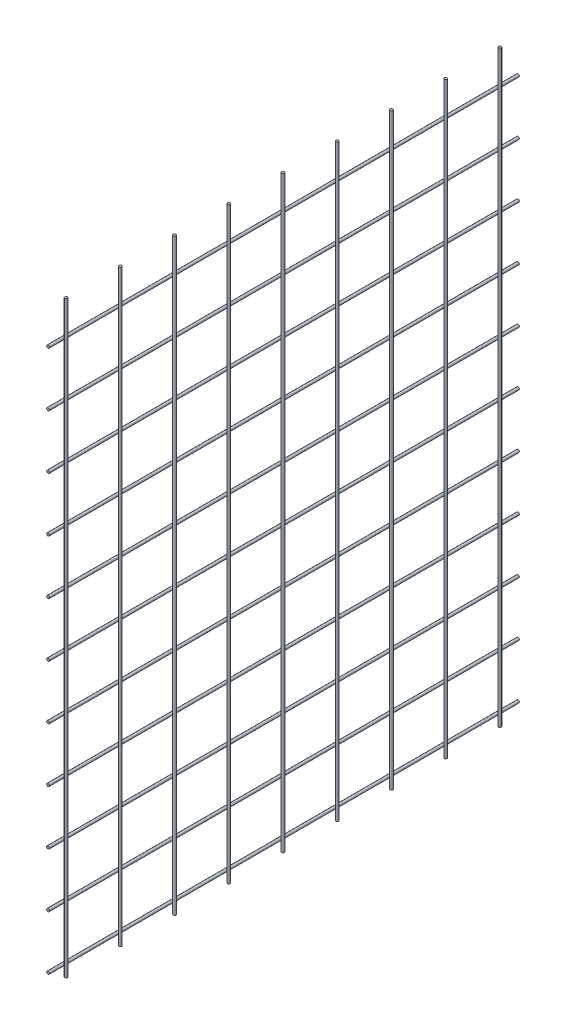
ISO-10303-21;
HEADER;
FILE_DESCRIPTION(('STEP AP214'),'2;1');
FILE_NAME('part.step','',(''),(''),'','','');
FILE_SCHEMA(('AUTOMOTIVE_DESIGN { 1 0 10303 214 1 1 1 1 }'));
ENDSEC;
DATA;
#1=APPLICATION_CONTEXT('core data for automotive mechanical design processes');
#2=APPLICATION_PROTOCOL_DEFINITION('international standard','automotive_design',2000,#1);
#3=PRODUCT_CONTEXT('',#1,'mechanical');
#4=PRODUCT('Part','Part','',(#3));
#5=PRODUCT_RELATED_PRODUCT_CATEGORY('part','',(#4));
#6=PRODUCT_DEFINITION_FORMATION('','',#4);
#7=PRODUCT_DEFINITION_CONTEXT('part definition',#1,'design');
#8=PRODUCT_DEFINITION('design','',#6,#7);
#9=PRODUCT_DEFINITION_SHAPE('','',#8);
#10=(LENGTH_UNIT() NAMED_UNIT(*) SI_UNIT(.MILLI.,.METRE.));
#11=(NAMED_UNIT(*) PLANE_ANGLE_UNIT() SI_UNIT($,.RADIAN.));
#12=(NAMED_UNIT(*) SI_UNIT($,.STERADIAN.) SOLID_ANGLE_UNIT());
#13=UNCERTAINTY_MEASURE_WITH_UNIT(LENGTH_MEASURE(1.E-05),#10,'distance_accuracy_value','');
#14=(GEOMETRIC_REPRESENTATION_CONTEXT(3) GLOBAL_UNCERTAINTY_ASSIGNED_CONTEXT((#13)) GLOBAL_UNIT_ASSIGNED_CONTEXT((#10,
#11,#12)) REPRESENTATION_CONTEXT('',''));
#15=CARTESIAN_POINT('',(0.,0.,0.));
#16=DIRECTION('',(0.,0.,1.));
#17=DIRECTION('',(1.,0.,0.));
#18=AXIS2_PLACEMENT_3D('',#15,#16,#17);
#19=CARTESIAN_POINT('',(-20.0100000000001,1940.,-1843.));
#20=DIRECTION('',(0.,0.,1.));
#21=DIRECTION('',(1.,0.,0.));
#22=AXIS2_PLACEMENT_3D('',#19,#20,#21);
#23=PLANE('',#22);
#24=CARTESIAN_POINT('',(3.10862446895044E-12,1300.,-1843.));
#25=DIRECTION('',(0.,0.,1.));
#26=DIRECTION('',(1.,0.,0.));
#27=AXIS2_PLACEMENT_3D('',#24,#25,#26);
#28=CIRCLE('',#27,1.49999999999986);
#29=CARTESIAN_POINT('',(1.50000000000297,1300.,-1843.));
#30=VERTEX_POINT('',#29);
#31=EDGE_CURVE('E11',#30,#30,#28,.T.);
#32=ORIENTED_EDGE('',*,*,#31,.T.);
#33=EDGE_LOOP('',(#32));
#34=FACE_BOUND('',#33,.T.);
#35=ADVANCED_FACE('F52',(#34),#23,.T.);
#36=CARTESIAN_POINT('',(-20.0100000000001,1940.,-2363.));
#37=DIRECTION('',(0.,0.,-1.));
#38=DIRECTION('',(-1.,0.,0.));
#39=AXIS2_PLACEMENT_3D('',#36,#37,#38);
#40=PLANE('',#39);
#41=CARTESIAN_POINT('',(-2.22044604925031E-12,1300.,-2363.));
#42=DIRECTION('',(0.,0.,-1.));
#43=DIRECTION('',(-1.,0.,0.));
#44=AXIS2_PLACEMENT_3D('',#41,#42,#43);
#45=CIRCLE('',#44,1.49999999999986);
#46=CARTESIAN_POINT('',(-1.50000000000209,1300.,-2363.));
#47=VERTEX_POINT('',#46);
#48=EDGE_CURVE('E60',#47,#47,#45,.T.);
#49=ORIENTED_EDGE('',*,*,#48,.T.);
#50=EDGE_LOOP('',(#49));
#51=FACE_BOUND('',#50,.T.);
#52=ADVANCED_FACE('F69',(#51),#40,.T.);
#53=CARTESIAN_POINT('',(3.10862446895044E-12,1300.,-3080.002));
#54=DIRECTION('',(0.,0.,1.));
#55=DIRECTION('',(1.,0.,0.));
#56=AXIS2_PLACEMENT_3D('',#53,#54,#55);
#57=CYLINDRICAL_SURFACE('',#56,1.49999999999986);
#58=ORIENTED_EDGE('',*,*,#48,.F.);
#59=EDGE_LOOP('',(#58));
#60=FACE_BOUND('',#59,.T.);
#61=ORIENTED_EDGE('',*,*,#31,.F.);
#62=EDGE_LOOP('',(#61));
#63=FACE_BOUND('',#62,.T.);
#64=ADVANCED_FACE('F54',(#60,#63),#57,.T.);
#65=CLOSED_SHELL('',(#35,#52,#64));
#66=MANIFOLD_SOLID_BREP('B2',#65);
#67=CARTESIAN_POINT('',(-20.0100000000001,1940.,-1843.));
#68=DIRECTION('',(0.,0.,1.));
#69=DIRECTION('',(1.,0.,0.));
#70=AXIS2_PLACEMENT_3D('',#67,#68,#69);
#71=PLANE('',#70);
#72=CARTESIAN_POINT('',(-2.22044604925031E-12,1360.,-1843.));
#73=DIRECTION('',(0.,0.,1.));
#74=DIRECTION('',(1.,0.,0.));
#75=AXIS2_PLACEMENT_3D('',#72,#73,#74);
#76=CIRCLE('',#75,1.49999999999986);
#77=CARTESIAN_POINT('',(1.49999999999764,1360.,-1843.));
#78=VERTEX_POINT('',#77);
#79=EDGE_CURVE('E51',#78,#78,#76,.T.);
#80=ORIENTED_EDGE('',*,*,#79,.T.);
#81=EDGE_LOOP('',(#80));
#82=FACE_BOUND('',#81,.T.);
#83=ADVANCED_FACE('F99',(#82),#71,.T.);
#84=CARTESIAN_POINT('',(-20.0100000000001,1940.,-2363.));
#85=DIRECTION('',(0.,0.,-1.));
#86=DIRECTION('',(-1.,0.,0.));
#87=AXIS2_PLACEMENT_3D('',#84,#85,#86);
#88=PLANE('',#87);
#89=CARTESIAN_POINT('',(-2.22044604925031E-12,1360.,-2363.));
#90=DIRECTION('',(0.,0.,-1.));
#91=DIRECTION('',(-1.,0.,0.));
#92=AXIS2_PLACEMENT_3D('',#89,#90,#91);
#93=CIRCLE('',#92,1.49999999999986);
#94=CARTESIAN_POINT('',(-1.50000000000209,1360.,-2363.));
#95=VERTEX_POINT('',#94);
#96=EDGE_CURVE('E107',#95,#95,#93,.T.);
#97=ORIENTED_EDGE('',*,*,#96,.T.);
#98=EDGE_LOOP('',(#97));
#99=FACE_BOUND('',#98,.T.);
#100=ADVANCED_FACE('F116',(#99),#88,.T.);
#101=CARTESIAN_POINT('',(3.10862446895044E-12,1360.,-3080.002));
#102=DIRECTION('',(0.,0.,1.));
#103=DIRECTION('',(1.,0.,0.));
#104=AXIS2_PLACEMENT_3D('',#101,#102,#103);
#105=CYLINDRICAL_SURFACE('',#104,1.49999999999986);
#106=ORIENTED_EDGE('',*,*,#96,.F.);
#107=EDGE_LOOP('',(#106));
#108=FACE_BOUND('',#107,.T.);
#109=ORIENTED_EDGE('',*,*,#79,.F.);
#110=EDGE_LOOP('',(#109));
#111=FACE_BOUND('',#110,.T.);
#112=ADVANCED_FACE('F101',(#108,#111),#105,.T.);
#113=CLOSED_SHELL('',(#83,#100,#112));
#114=MANIFOLD_SOLID_BREP('B6',#113);
#115=CARTESIAN_POINT('',(-20.0100000000001,1940.,-1843.));
#116=DIRECTION('',(0.,0.,1.));
#117=DIRECTION('',(1.,0.,0.));
#118=AXIS2_PLACEMENT_3D('',#115,#116,#117);
#119=PLANE('',#118);
#120=CARTESIAN_POINT('',(-2.22044604925031E-12,1420.,-1843.));
#121=DIRECTION('',(0.,0.,1.));
#122=DIRECTION('',(1.,0.,0.));
#123=AXIS2_PLACEMENT_3D('',#120,#121,#122);
#124=CIRCLE('',#123,1.49999999999986);
#125=CARTESIAN_POINT('',(1.49999999999764,1420.,-1843.));
#126=VERTEX_POINT('',#125);
#127=EDGE_CURVE('E98',#126,#126,#124,.T.);
#128=ORIENTED_EDGE('',*,*,#127,.T.);
#129=EDGE_LOOP('',(#128));
#130=FACE_BOUND('',#129,.T.);
#131=ADVANCED_FACE('F146',(#130),#119,.T.);
#132=CARTESIAN_POINT('',(-20.0100000000001,1940.,-2363.));
#133=DIRECTION('',(0.,0.,-1.));
#134=DIRECTION('',(-1.,0.,0.));
#135=AXIS2_PLACEMENT_3D('',#132,#133,#134);
#136=PLANE('',#135);
#137=CARTESIAN_POINT('',(-2.22044604925031E-12,1420.,-2363.));
#138=DIRECTION('',(0.,0.,-1.));
#139=DIRECTION('',(-1.,0.,0.));
#140=AXIS2_PLACEMENT_3D('',#137,#138,#139);
#141=CIRCLE('',#140,1.49999999999986);
#142=CARTESIAN_POINT('',(-1.50000000000209,1420.,-2363.));
#143=VERTEX_POINT('',#142);
#144=EDGE_CURVE('E154',#143,#143,#141,.T.);
#145=ORIENTED_EDGE('',*,*,#144,.T.);
#146=EDGE_LOOP('',(#145));
#147=FACE_BOUND('',#146,.T.);
#148=ADVANCED_FACE('F163',(#147),#136,.T.);
#149=CARTESIAN_POINT('',(3.10862446895044E-12,1420.,-3080.002));
#150=DIRECTION('',(0.,0.,1.));
#151=DIRECTION('',(1.,0.,0.));
#152=AXIS2_PLACEMENT_3D('',#149,#150,#151);
#153=CYLINDRICAL_SURFACE('',#152,1.49999999999986);
#154=ORIENTED_EDGE('',*,*,#144,.F.);
#155=EDGE_LOOP('',(#154));
#156=FACE_BOUND('',#155,.T.);
#157=ORIENTED_EDGE('',*,*,#127,.F.);
#158=EDGE_LOOP('',(#157));
#159=FACE_BOUND('',#158,.T.);
#160=ADVANCED_FACE('F148',(#156,#159),#153,.T.);
#161=CLOSED_SHELL('',(#131,#148,#160));
#162=MANIFOLD_SOLID_BREP('B46',#161);
#163=CARTESIAN_POINT('',(-20.0100000000001,1940.,-1843.));
#164=DIRECTION('',(0.,0.,1.));
#165=DIRECTION('',(1.,0.,0.));
#166=AXIS2_PLACEMENT_3D('',#163,#164,#165);
#167=PLANE('',#166);
#168=CARTESIAN_POINT('',(-8.88178419700125E-13,1480.,-1843.));
#169=DIRECTION('',(0.,0.,1.));
#170=DIRECTION('',(1.,0.,0.));
#171=AXIS2_PLACEMENT_3D('',#168,#169,#170);
#172=CIRCLE('',#171,1.49999999999986);
#173=CARTESIAN_POINT('',(1.49999999999898,1480.,-1843.));
#174=VERTEX_POINT('',#173);
#175=EDGE_CURVE('E145',#174,#174,#172,.T.);
#176=ORIENTED_EDGE('',*,*,#175,.T.);
#177=EDGE_LOOP('',(#176));
#178=FACE_BOUND('',#177,.T.);
#179=ADVANCED_FACE('F193',(#178),#167,.T.);
#180=CARTESIAN_POINT('',(-20.0100000000001,1940.,-2363.));
#181=DIRECTION('',(0.,0.,-1.));
#182=DIRECTION('',(-1.,0.,0.));
#183=AXIS2_PLACEMENT_3D('',#180,#181,#182);
#184=PLANE('',#183);
#185=CARTESIAN_POINT('',(-8.88178419700125E-13,1480.,-2363.));
#186=DIRECTION('',(0.,0.,-1.));
#187=DIRECTION('',(-1.,0.,0.));
#188=AXIS2_PLACEMENT_3D('',#185,#186,#187);
#189=CIRCLE('',#188,1.49999999999986);
#190=CARTESIAN_POINT('',(-1.50000000000075,1480.,-2363.));
#191=VERTEX_POINT('',#190);
#192=EDGE_CURVE('E201',#191,#191,#189,.T.);
#193=ORIENTED_EDGE('',*,*,#192,.T.);
#194=EDGE_LOOP('',(#193));
#195=FACE_BOUND('',#194,.T.);
#196=ADVANCED_FACE('F210',(#195),#184,.T.);
#197=CARTESIAN_POINT('',(-8.88178419700125E-13,1480.,-3080.002));
#198=DIRECTION('',(0.,0.,1.));
#199=DIRECTION('',(1.,0.,0.));
#200=AXIS2_PLACEMENT_3D('',#197,#198,#199);
#201=CYLINDRICAL_SURFACE('',#200,1.49999999999986);
#202=ORIENTED_EDGE('',*,*,#192,.F.);
#203=EDGE_LOOP('',(#202));
#204=FACE_BOUND('',#203,.T.);
#205=ORIENTED_EDGE('',*,*,#175,.F.);
#206=EDGE_LOOP('',(#205));
#207=FACE_BOUND('',#206,.T.);
#208=ADVANCED_FACE('F195',(#204,#207),#201,.T.);
#209=CLOSED_SHELL('',(#179,#196,#208));
#210=MANIFOLD_SOLID_BREP('B93',#209);
#211=CARTESIAN_POINT('',(-20.0100000000001,1940.,-1843.));
#212=DIRECTION('',(0.,0.,1.));
#213=DIRECTION('',(1.,0.,0.));
#214=AXIS2_PLACEMENT_3D('',#211,#212,#213);
#215=PLANE('',#214);
#216=CARTESIAN_POINT('',(-8.88178419700125E-13,1540.,-1843.));
#217=DIRECTION('',(0.,0.,1.));
#218=DIRECTION('',(1.,0.,0.));
#219=AXIS2_PLACEMENT_3D('',#216,#217,#218);
#220=CIRCLE('',#219,1.49999999999986);
#221=CARTESIAN_POINT('',(1.49999999999898,1540.,-1843.));
#222=VERTEX_POINT('',#221);
#223=EDGE_CURVE('E192',#222,#222,#220,.T.);
#224=ORIENTED_EDGE('',*,*,#223,.T.);
#225=EDGE_LOOP('',(#224));
#226=FACE_BOUND('',#225,.T.);
#227=ADVANCED_FACE('F240',(#226),#215,.T.);
#228=CARTESIAN_POINT('',(-20.0100000000001,1940.,-2363.));
#229=DIRECTION('',(0.,0.,-1.));
#230=DIRECTION('',(-1.,0.,0.));
#231=AXIS2_PLACEMENT_3D('',#228,#229,#230);
#232=PLANE('',#231);
#233=CARTESIAN_POINT('',(-8.88178419700125E-13,1540.,-2363.));
#234=DIRECTION('',(0.,0.,-1.));
#235=DIRECTION('',(-1.,0.,0.));
#236=AXIS2_PLACEMENT_3D('',#233,#234,#235);
#237=CIRCLE('',#236,1.49999999999986);
#238=CARTESIAN_POINT('',(-1.50000000000075,1540.,-2363.));
#239=VERTEX_POINT('',#238);
#240=EDGE_CURVE('E248',#239,#239,#237,.T.);
#241=ORIENTED_EDGE('',*,*,#240,.T.);
#242=EDGE_LOOP('',(#241));
#243=FACE_BOUND('',#242,.T.);
#244=ADVANCED_FACE('F257',(#243),#232,.T.);
#245=CARTESIAN_POINT('',(4.44089209850063E-12,1540.,-3080.002));
#246=DIRECTION('',(0.,0.,1.));
#247=DIRECTION('',(1.,0.,0.));
#248=AXIS2_PLACEMENT_3D('',#245,#246,#247);
#249=CYLINDRICAL_SURFACE('',#248,1.49999999999986);
#250=ORIENTED_EDGE('',*,*,#240,.F.);
#251=EDGE_LOOP('',(#250));
#252=FACE_BOUND('',#251,.T.);
#253=ORIENTED_EDGE('',*,*,#223,.F.);
#254=EDGE_LOOP('',(#253));
#255=FACE_BOUND('',#254,.T.);
#256=ADVANCED_FACE('F242',(#252,#255),#249,.T.);
#257=CLOSED_SHELL('',(#227,#244,#256));
#258=MANIFOLD_SOLID_BREP('B140',#257);
#259=CARTESIAN_POINT('',(-20.0100000000001,1940.,-1843.));
#260=DIRECTION('',(0.,0.,1.));
#261=DIRECTION('',(1.,0.,0.));
#262=AXIS2_PLACEMENT_3D('',#259,#260,#261);
#263=PLANE('',#262);
#264=CARTESIAN_POINT('',(4.44089209850063E-12,1600.,-1843.));
#265=DIRECTION('',(0.,0.,1.));
#266=DIRECTION('',(1.,0.,0.));
#267=AXIS2_PLACEMENT_3D('',#264,#265,#266);
#268=CIRCLE('',#267,1.49999999999986);
#269=CARTESIAN_POINT('',(1.50000000000431,1600.,-1843.));
#270=VERTEX_POINT('',#269);
#271=EDGE_CURVE('E239',#270,#270,#268,.T.);
#272=ORIENTED_EDGE('',*,*,#271,.T.);
#273=EDGE_LOOP('',(#272));
#274=FACE_BOUND('',#273,.T.);
#275=ADVANCED_FACE('F287',(#274),#263,.T.);
#276=CARTESIAN_POINT('',(-20.0100000000001,1940.,-2363.));
#277=DIRECTION('',(0.,0.,-1.));
#278=DIRECTION('',(-1.,0.,0.));
#279=AXIS2_PLACEMENT_3D('',#276,#277,#278);
#280=PLANE('',#279);
#281=CARTESIAN_POINT('',(4.44089209850063E-12,1600.,-2363.));
#282=DIRECTION('',(0.,0.,-1.));
#283=DIRECTION('',(-1.,0.,0.));
#284=AXIS2_PLACEMENT_3D('',#281,#282,#283);
#285=CIRCLE('',#284,1.49999999999986);
#286=CARTESIAN_POINT('',(-1.49999999999542,1600.,-2363.));
#287=VERTEX_POINT('',#286);
#288=EDGE_CURVE('E295',#287,#287,#285,.T.);
#289=ORIENTED_EDGE('',*,*,#288,.T.);
#290=EDGE_LOOP('',(#289));
#291=FACE_BOUND('',#290,.T.);
#292=ADVANCED_FACE('F304',(#291),#280,.T.);
#293=CARTESIAN_POINT('',(4.44089209850063E-12,1600.,-3080.002));
#294=DIRECTION('',(0.,0.,1.));
#295=DIRECTION('',(1.,0.,0.));
#296=AXIS2_PLACEMENT_3D('',#293,#294,#295);
#297=CYLINDRICAL_SURFACE('',#296,1.49999999999986);
#298=ORIENTED_EDGE('',*,*,#288,.F.);
#299=EDGE_LOOP('',(#298));
#300=FACE_BOUND('',#299,.T.);
#301=ORIENTED_EDGE('',*,*,#271,.F.);
#302=EDGE_LOOP('',(#301));
#303=FACE_BOUND('',#302,.T.);
#304=ADVANCED_FACE('F289',(#300,#303),#297,.T.);
#305=CLOSED_SHELL('',(#275,#292,#304));
#306=MANIFOLD_SOLID_BREP('B187',#305);
#307=CARTESIAN_POINT('',(-20.0100000000001,1940.,-1843.));
#308=DIRECTION('',(0.,0.,1.));
#309=DIRECTION('',(1.,0.,0.));
#310=AXIS2_PLACEMENT_3D('',#307,#308,#309);
#311=PLANE('',#310);
#312=CARTESIAN_POINT('',(0.,1660.,-1843.));
#313=DIRECTION('',(0.,0.,1.));
#314=DIRECTION('',(1.,0.,0.));
#315=AXIS2_PLACEMENT_3D('',#312,#313,#314);
#316=CIRCLE('',#315,1.49999999999986);
#317=CARTESIAN_POINT('',(1.49999999999986,1660.,-1843.));
#318=VERTEX_POINT('',#317);
#319=EDGE_CURVE('E286',#318,#318,#316,.T.);
#320=ORIENTED_EDGE('',*,*,#319,.T.);
#321=EDGE_LOOP('',(#320));
#322=FACE_BOUND('',#321,.T.);
#323=ADVANCED_FACE('F334',(#322),#311,.T.);
#324=CARTESIAN_POINT('',(-20.0100000000001,1940.,-2363.));
#325=DIRECTION('',(0.,0.,-1.));
#326=DIRECTION('',(-1.,0.,0.));
#327=AXIS2_PLACEMENT_3D('',#324,#325,#326);
#328=PLANE('',#327);
#329=CARTESIAN_POINT('',(0.,1660.,-2363.));
#330=DIRECTION('',(0.,0.,-1.));
#331=DIRECTION('',(-1.,0.,0.));
#332=AXIS2_PLACEMENT_3D('',#329,#330,#331);
#333=CIRCLE('',#332,1.49999999999986);
#334=CARTESIAN_POINT('',(-1.49999999999986,1660.,-2363.));
#335=VERTEX_POINT('',#334);
#336=EDGE_CURVE('E342',#335,#335,#333,.T.);
#337=ORIENTED_EDGE('',*,*,#336,.T.);
#338=EDGE_LOOP('',(#337));
#339=FACE_BOUND('',#338,.T.);
#340=ADVANCED_FACE('F351',(#339),#328,.T.);
#341=CARTESIAN_POINT('',(5.32907051820075E-12,1660.,-3080.002));
#342=DIRECTION('',(0.,0.,1.));
#343=DIRECTION('',(1.,0.,0.));
#344=AXIS2_PLACEMENT_3D('',#341,#342,#343);
#345=CYLINDRICAL_SURFACE('',#344,1.49999999999986);
#346=ORIENTED_EDGE('',*,*,#336,.F.);
#347=EDGE_LOOP('',(#346));
#348=FACE_BOUND('',#347,.T.);
#349=ORIENTED_EDGE('',*,*,#319,.F.);
#350=EDGE_LOOP('',(#349));
#351=FACE_BOUND('',#350,.T.);
#352=ADVANCED_FACE('F336',(#348,#351),#345,.T.);
#353=CLOSED_SHELL('',(#323,#340,#352));
#354=MANIFOLD_SOLID_BREP('B234',#353);
#355=CARTESIAN_POINT('',(-20.0100000000001,1940.,-1843.));
#356=DIRECTION('',(0.,0.,1.));
#357=DIRECTION('',(1.,0.,0.));
#358=AXIS2_PLACEMENT_3D('',#355,#356,#357);
#359=PLANE('',#358);
#360=CARTESIAN_POINT('',(5.32907051820075E-12,1720.,-1843.));
#361=DIRECTION('',(0.,0.,1.));
#362=DIRECTION('',(1.,0.,0.));
#363=AXIS2_PLACEMENT_3D('',#360,#361,#362);
#364=CIRCLE('',#363,1.49999999999986);
#365=CARTESIAN_POINT('',(1.50000000000519,1720.,-1843.));
#366=VERTEX_POINT('',#365);
#367=EDGE_CURVE('E333',#366,#366,#364,.T.);
#368=ORIENTED_EDGE('',*,*,#367,.T.);
#369=EDGE_LOOP('',(#368));
#370=FACE_BOUND('',#369,.T.);
#371=ADVANCED_FACE('F381',(#370),#359,.T.);
#372=CARTESIAN_POINT('',(-20.0100000000001,1940.,-2363.));
#373=DIRECTION('',(0.,0.,-1.));
#374=DIRECTION('',(-1.,0.,0.));
#375=AXIS2_PLACEMENT_3D('',#372,#373,#374);
#376=PLANE('',#375);
#377=CARTESIAN_POINT('',(0.,1720.,-2363.));
#378=DIRECTION('',(0.,0.,-1.));
#379=DIRECTION('',(-1.,0.,0.));
#380=AXIS2_PLACEMENT_3D('',#377,#378,#379);
#381=CIRCLE('',#380,1.49999999999986);
#382=CARTESIAN_POINT('',(-1.49999999999986,1720.,-2363.));
#383=VERTEX_POINT('',#382);
#384=EDGE_CURVE('E389',#383,#383,#381,.T.);
#385=ORIENTED_EDGE('',*,*,#384,.T.);
#386=EDGE_LOOP('',(#385));
#387=FACE_BOUND('',#386,.T.);
#388=ADVANCED_FACE('F398',(#387),#376,.T.);
#389=CARTESIAN_POINT('',(5.32907051820075E-12,1720.,-3080.002));
#390=DIRECTION('',(0.,0.,1.));
#391=DIRECTION('',(1.,0.,0.));
#392=AXIS2_PLACEMENT_3D('',#389,#390,#391);
#393=CYLINDRICAL_SURFACE('',#392,1.49999999999986);
#394=ORIENTED_EDGE('',*,*,#384,.F.);
#395=EDGE_LOOP('',(#394));
#396=FACE_BOUND('',#395,.T.);
#397=ORIENTED_EDGE('',*,*,#367,.F.);
#398=EDGE_LOOP('',(#397));
#399=FACE_BOUND('',#398,.T.);
#400=ADVANCED_FACE('F383',(#396,#399),#393,.T.);
#401=CLOSED_SHELL('',(#371,#388,#400));
#402=MANIFOLD_SOLID_BREP('B281',#401);
#403=CARTESIAN_POINT('',(-20.0100000000001,1940.,-1843.));
#404=DIRECTION('',(0.,0.,1.));
#405=DIRECTION('',(1.,0.,0.));
#406=AXIS2_PLACEMENT_3D('',#403,#404,#405);
#407=PLANE('',#406);
#408=CARTESIAN_POINT('',(0.,1780.,-1843.));
#409=DIRECTION('',(0.,0.,1.));
#410=DIRECTION('',(1.,0.,0.));
#411=AXIS2_PLACEMENT_3D('',#408,#409,#410);
#412=CIRCLE('',#411,1.49999999999986);
#413=CARTESIAN_POINT('',(1.49999999999986,1780.,-1843.));
#414=VERTEX_POINT('',#413);
#415=EDGE_CURVE('E380',#414,#414,#412,.T.);
#416=ORIENTED_EDGE('',*,*,#415,.T.);
#417=EDGE_LOOP('',(#416));
#418=FACE_BOUND('',#417,.T.);
#419=ADVANCED_FACE('F428',(#418),#407,.T.);
#420=CARTESIAN_POINT('',(-20.0100000000001,1940.,-2363.));
#421=DIRECTION('',(0.,0.,-1.));
#422=DIRECTION('',(-1.,0.,0.));
#423=AXIS2_PLACEMENT_3D('',#420,#421,#422);
#424=PLANE('',#423);
#425=CARTESIAN_POINT('',(0.,1780.,-2363.));
#426=DIRECTION('',(0.,0.,-1.));
#427=DIRECTION('',(-1.,0.,0.));
#428=AXIS2_PLACEMENT_3D('',#425,#426,#427);
#429=CIRCLE('',#428,1.49999999999986);
#430=CARTESIAN_POINT('',(-1.49999999999986,1780.,-2363.));
#431=VERTEX_POINT('',#430);
#432=EDGE_CURVE('E436',#431,#431,#429,.T.);
#433=ORIENTED_EDGE('',*,*,#432,.T.);
#434=EDGE_LOOP('',(#433));
#435=FACE_BOUND('',#434,.T.);
#436=ADVANCED_FACE('F445',(#435),#424,.T.);
#437=CARTESIAN_POINT('',(0.,1780.,-3080.002));
#438=DIRECTION('',(0.,0.,1.));
#439=DIRECTION('',(1.,0.,0.));
#440=AXIS2_PLACEMENT_3D('',#437,#438,#439);
#441=CYLINDRICAL_SURFACE('',#440,1.49999999999986);
#442=ORIENTED_EDGE('',*,*,#432,.F.);
#443=EDGE_LOOP('',(#442));
#444=FACE_BOUND('',#443,.T.);
#445=ORIENTED_EDGE('',*,*,#415,.F.);
#446=EDGE_LOOP('',(#445));
#447=FACE_BOUND('',#446,.T.);
#448=ADVANCED_FACE('F430',(#444,#447),#441,.T.);
#449=CLOSED_SHELL('',(#419,#436,#448));
#450=MANIFOLD_SOLID_BREP('B328',#449);
#451=CARTESIAN_POINT('',(-20.0100000000001,1940.,-1843.));
#452=DIRECTION('',(0.,0.,1.));
#453=DIRECTION('',(1.,0.,0.));
#454=AXIS2_PLACEMENT_3D('',#451,#452,#453);
#455=PLANE('',#454);
#456=CARTESIAN_POINT('',(0.,1840.,-1843.));
#457=DIRECTION('',(0.,0.,1.));
#458=DIRECTION('',(1.,0.,0.));
#459=AXIS2_PLACEMENT_3D('',#456,#457,#458);
#460=CIRCLE('',#459,1.49999999999986);
#461=CARTESIAN_POINT('',(1.49999999999986,1840.,-1843.));
#462=VERTEX_POINT('',#461);
#463=EDGE_CURVE('E427',#462,#462,#460,.T.);
#464=ORIENTED_EDGE('',*,*,#463,.T.);
#465=EDGE_LOOP('',(#464));
#466=FACE_BOUND('',#465,.T.);
#467=ADVANCED_FACE('F475',(#466),#455,.T.);
#468=CARTESIAN_POINT('',(-20.0100000000001,1940.,-2363.));
#469=DIRECTION('',(0.,0.,-1.));
#470=DIRECTION('',(-1.,0.,0.));
#471=AXIS2_PLACEMENT_3D('',#468,#469,#470);
#472=PLANE('',#471);
#473=CARTESIAN_POINT('',(0.,1840.,-2363.));
#474=DIRECTION('',(0.,0.,-1.));
#475=DIRECTION('',(-1.,0.,0.));
#476=AXIS2_PLACEMENT_3D('',#473,#474,#475);
#477=CIRCLE('',#476,1.49999999999986);
#478=CARTESIAN_POINT('',(-1.49999999999986,1840.,-2363.));
#479=VERTEX_POINT('',#478);
#480=EDGE_CURVE('E483',#479,#479,#477,.T.);
#481=ORIENTED_EDGE('',*,*,#480,.T.);
#482=EDGE_LOOP('',(#481));
#483=FACE_BOUND('',#482,.T.);
#484=ADVANCED_FACE('F492',(#483),#472,.T.);
#485=CARTESIAN_POINT('',(5.32907051820075E-12,1840.,-3080.002));
#486=DIRECTION('',(0.,0.,1.));
#487=DIRECTION('',(1.,0.,0.));
#488=AXIS2_PLACEMENT_3D('',#485,#486,#487);
#489=CYLINDRICAL_SURFACE('',#488,1.49999999999986);
#490=ORIENTED_EDGE('',*,*,#480,.F.);
#491=EDGE_LOOP('',(#490));
#492=FACE_BOUND('',#491,.T.);
#493=ORIENTED_EDGE('',*,*,#463,.F.);
#494=EDGE_LOOP('',(#493));
#495=FACE_BOUND('',#494,.T.);
#496=ADVANCED_FACE('F477',(#492,#495),#489,.T.);
#497=CLOSED_SHELL('',(#467,#484,#496));
#498=MANIFOLD_SOLID_BREP('B375',#497);
#499=CARTESIAN_POINT('',(-20.0100000000001,1940.,-1843.));
#500=DIRECTION('',(0.,0.,1.));
#501=DIRECTION('',(1.,0.,0.));
#502=AXIS2_PLACEMENT_3D('',#499,#500,#501);
#503=PLANE('',#502);
#504=CARTESIAN_POINT('',(0.,1900.,-1843.));
#505=DIRECTION('',(0.,0.,1.));
#506=DIRECTION('',(1.,0.,0.));
#507=AXIS2_PLACEMENT_3D('',#504,#505,#506);
#508=CIRCLE('',#507,1.49999999999986);
#509=CARTESIAN_POINT('',(1.49999999999986,1900.,-1843.));
#510=VERTEX_POINT('',#509);
#511=EDGE_CURVE('E474',#510,#510,#508,.T.);
#512=ORIENTED_EDGE('',*,*,#511,.T.);
#513=EDGE_LOOP('',(#512));
#514=FACE_BOUND('',#513,.T.);
#515=ADVANCED_FACE('F522',(#514),#503,.T.);
#516=CARTESIAN_POINT('',(-20.0100000000001,1940.,-2363.));
#517=DIRECTION('',(0.,0.,-1.));
#518=DIRECTION('',(-1.,0.,0.));
#519=AXIS2_PLACEMENT_3D('',#516,#517,#518);
#520=PLANE('',#519);
#521=CARTESIAN_POINT('',(0.,1900.,-2363.));
#522=DIRECTION('',(0.,0.,-1.));
#523=DIRECTION('',(-1.,0.,0.));
#524=AXIS2_PLACEMENT_3D('',#521,#522,#523);
#525=CIRCLE('',#524,1.49999999999986);
#526=CARTESIAN_POINT('',(-1.49999999999986,1900.,-2363.));
#527=VERTEX_POINT('',#526);
#528=EDGE_CURVE('E530',#527,#527,#525,.T.);
#529=ORIENTED_EDGE('',*,*,#528,.T.);
#530=EDGE_LOOP('',(#529));
#531=FACE_BOUND('',#530,.T.);
#532=ADVANCED_FACE('F539',(#531),#520,.T.);
#533=CARTESIAN_POINT('',(0.,1900.,-3080.002));
#534=DIRECTION('',(0.,0.,1.));
#535=DIRECTION('',(1.,0.,0.));
#536=AXIS2_PLACEMENT_3D('',#533,#534,#535);
#537=CYLINDRICAL_SURFACE('',#536,1.49999999999986);
#538=ORIENTED_EDGE('',*,*,#528,.F.);
#539=EDGE_LOOP('',(#538));
#540=FACE_BOUND('',#539,.T.);
#541=ORIENTED_EDGE('',*,*,#511,.F.);
#542=EDGE_LOOP('',(#541));
#543=FACE_BOUND('',#542,.T.);
#544=ADVANCED_FACE('F524',(#540,#543),#537,.T.);
#545=CLOSED_SHELL('',(#515,#532,#544));
#546=MANIFOLD_SOLID_BREP('B422',#545);
#547=CARTESIAN_POINT('',(-20.0100000000005,1289.,-1843.));
#548=DIRECTION('',(0.,-1.,0.));
#549=DIRECTION('',(0.,0.,-1.));
#550=AXIS2_PLACEMENT_3D('',#547,#548,#549);
#551=PLANE('',#550);
#552=CARTESIAN_POINT('',(3.00000000000411,1289.,-2340.));
#553=DIRECTION('',(0.,-1.,0.));
#554=DIRECTION('',(0.,0.,-1.));
#555=AXIS2_PLACEMENT_3D('',#552,#553,#554);
#556=CIRCLE('',#555,1.5);
#557=CARTESIAN_POINT('',(3.00000000000411,1289.,-2341.5));
#558=VERTEX_POINT('',#557);
#559=EDGE_CURVE('E573',#558,#558,#556,.T.);
#560=ORIENTED_EDGE('',*,*,#559,.T.);
#561=EDGE_LOOP('',(#560));
#562=FACE_BOUND('',#561,.T.);
#563=ADVANCED_FACE('F569',(#562),#551,.T.);
#564=CARTESIAN_POINT('',(3.00000000000544,1980.002,-2340.));
#565=DIRECTION('',(0.,-1.,0.));
#566=DIRECTION('',(0.,0.,-1.));
#567=AXIS2_PLACEMENT_3D('',#564,#565,#566);
#568=CYLINDRICAL_SURFACE('',#567,1.5);
#569=CARTESIAN_POINT('',(3.00000000000011,1940.,-2340.));
#570=DIRECTION('',(0.,1.,0.));
#571=DIRECTION('',(0.,0.,1.));
#572=AXIS2_PLACEMENT_3D('',#569,#570,#571);
#573=CIRCLE('',#572,1.5);
#574=CARTESIAN_POINT('',(3.00000000000011,1940.,-2338.5));
#575=VERTEX_POINT('',#574);
#576=EDGE_CURVE('E521',#575,#575,#573,.T.);
#577=ORIENTED_EDGE('',*,*,#576,.F.);
#578=EDGE_LOOP('',(#577));
#579=FACE_BOUND('',#578,.T.);
#580=ORIENTED_EDGE('',*,*,#559,.F.);
#581=EDGE_LOOP('',(#580));
#582=FACE_BOUND('',#581,.T.);
#583=ADVANCED_FACE('F571',(#579,#582),#568,.T.);
#584=CARTESIAN_POINT('',(-15.5000000000003,1940.,-3060.));
#585=DIRECTION('',(0.,1.,0.));
#586=DIRECTION('',(0.,0.,1.));
#587=AXIS2_PLACEMENT_3D('',#584,#585,#586);
#588=PLANE('',#587);
#589=ORIENTED_EDGE('',*,*,#576,.T.);
#590=EDGE_LOOP('',(#589));
#591=FACE_BOUND('',#590,.T.);
#592=ADVANCED_FACE('F588',(#591),#588,.T.);
#593=CLOSED_SHELL('',(#563,#583,#592));
#594=MANIFOLD_SOLID_BREP('B469',#593);
#595=CARTESIAN_POINT('',(-20.0100000000005,1289.,-1843.));
#596=DIRECTION('',(0.,-1.,0.));
#597=DIRECTION('',(0.,0.,-1.));
#598=AXIS2_PLACEMENT_3D('',#595,#596,#597);
#599=PLANE('',#598);
#600=CARTESIAN_POINT('',(2.99999999999923,1289.,-2280.));
#601=DIRECTION('',(0.,-1.,0.));
#602=DIRECTION('',(0.,0.,-1.));
#603=AXIS2_PLACEMENT_3D('',#600,#601,#602);
#604=CIRCLE('',#603,1.5);
#605=CARTESIAN_POINT('',(2.99999999999923,1289.,-2281.5));
#606=VERTEX_POINT('',#605);
#607=EDGE_CURVE('E620',#606,#606,#604,.T.);
#608=ORIENTED_EDGE('',*,*,#607,.T.);
#609=EDGE_LOOP('',(#608));
#610=FACE_BOUND('',#609,.T.);
#611=ADVANCED_FACE('F616',(#610),#599,.T.);
#612=CARTESIAN_POINT('',(3.00000000000544,1980.002,-2280.));
#613=DIRECTION('',(0.,-1.,0.));
#614=DIRECTION('',(0.,0.,-1.));
#615=AXIS2_PLACEMENT_3D('',#612,#613,#614);
#616=CYLINDRICAL_SURFACE('',#615,1.5);
#617=CARTESIAN_POINT('',(3.00000000000011,1940.,-2280.));
#618=DIRECTION('',(0.,1.,0.));
#619=DIRECTION('',(0.,0.,1.));
#620=AXIS2_PLACEMENT_3D('',#617,#618,#619);
#621=CIRCLE('',#620,1.5);
#622=CARTESIAN_POINT('',(3.00000000000011,1940.,-2278.5));
#623=VERTEX_POINT('',#622);
#624=EDGE_CURVE('E568',#623,#623,#621,.T.);
#625=ORIENTED_EDGE('',*,*,#624,.F.);
#626=EDGE_LOOP('',(#625));
#627=FACE_BOUND('',#626,.T.);
#628=ORIENTED_EDGE('',*,*,#607,.F.);
#629=EDGE_LOOP('',(#628));
#630=FACE_BOUND('',#629,.T.);
#631=ADVANCED_FACE('F618',(#627,#630),#616,.T.);
#632=CARTESIAN_POINT('',(-15.5000000000003,1940.,-3060.));
#633=DIRECTION('',(0.,1.,0.));
#634=DIRECTION('',(0.,0.,1.));
#635=AXIS2_PLACEMENT_3D('',#632,#633,#634);
#636=PLANE('',#635);
#637=ORIENTED_EDGE('',*,*,#624,.T.);
#638=EDGE_LOOP('',(#637));
#639=FACE_BOUND('',#638,.T.);
#640=ADVANCED_FACE('F635',(#639),#636,.T.);
#641=CLOSED_SHELL('',(#611,#631,#640));
#642=MANIFOLD_SOLID_BREP('B516',#641);
#643=CARTESIAN_POINT('',(-20.0100000000005,1289.,-1843.));
#644=DIRECTION('',(0.,-1.,0.));
#645=DIRECTION('',(0.,0.,-1.));
#646=AXIS2_PLACEMENT_3D('',#643,#644,#645);
#647=PLANE('',#646);
#648=CARTESIAN_POINT('',(2.99999999999923,1289.,-2220.));
#649=DIRECTION('',(0.,-1.,0.));
#650=DIRECTION('',(0.,0.,-1.));
#651=AXIS2_PLACEMENT_3D('',#648,#649,#650);
#652=CIRCLE('',#651,1.5);
#653=CARTESIAN_POINT('',(2.99999999999923,1289.,-2221.5));
#654=VERTEX_POINT('',#653);
#655=EDGE_CURVE('E667',#654,#654,#652,.T.);
#656=ORIENTED_EDGE('',*,*,#655,.T.);
#657=EDGE_LOOP('',(#656));
#658=FACE_BOUND('',#657,.T.);
#659=ADVANCED_FACE('F663',(#658),#647,.T.);
#660=CARTESIAN_POINT('',(3.000000000005,1980.002,-2220.));
#661=DIRECTION('',(0.,-1.,0.));
#662=DIRECTION('',(0.,0.,-1.));
#663=AXIS2_PLACEMENT_3D('',#660,#661,#662);
#664=CYLINDRICAL_SURFACE('',#663,1.5);
#665=CARTESIAN_POINT('',(3.00000000000011,1940.,-2220.));
#666=DIRECTION('',(0.,1.,0.));
#667=DIRECTION('',(0.,0.,1.));
#668=AXIS2_PLACEMENT_3D('',#665,#666,#667);
#669=CIRCLE('',#668,1.5);
#670=CARTESIAN_POINT('',(3.00000000000011,1940.,-2218.5));
#671=VERTEX_POINT('',#670);
#672=EDGE_CURVE('E615',#671,#671,#669,.T.);
#673=ORIENTED_EDGE('',*,*,#672,.F.);
#674=EDGE_LOOP('',(#673));
#675=FACE_BOUND('',#674,.T.);
#676=ORIENTED_EDGE('',*,*,#655,.F.);
#677=EDGE_LOOP('',(#676));
#678=FACE_BOUND('',#677,.T.);
#679=ADVANCED_FACE('F665',(#675,#678),#664,.T.);
#680=CARTESIAN_POINT('',(-15.5000000000003,1940.,-3060.));
#681=DIRECTION('',(0.,1.,0.));
#682=DIRECTION('',(0.,0.,1.));
#683=AXIS2_PLACEMENT_3D('',#680,#681,#682);
#684=PLANE('',#683);
#685=ORIENTED_EDGE('',*,*,#672,.T.);
#686=EDGE_LOOP('',(#685));
#687=FACE_BOUND('',#686,.T.);
#688=ADVANCED_FACE('F682',(#687),#684,.T.);
#689=CLOSED_SHELL('',(#659,#679,#688));
#690=MANIFOLD_SOLID_BREP('B563',#689);
#691=CARTESIAN_POINT('',(-20.0100000000005,1289.,-1843.));
#692=DIRECTION('',(0.,-1.,0.));
#693=DIRECTION('',(0.,0.,-1.));
#694=AXIS2_PLACEMENT_3D('',#691,#692,#693);
#695=PLANE('',#694);
#696=CARTESIAN_POINT('',(2.99999999999923,1289.,-2160.));
#697=DIRECTION('',(0.,-1.,0.));
#698=DIRECTION('',(0.,0.,-1.));
#699=AXIS2_PLACEMENT_3D('',#696,#697,#698);
#700=CIRCLE('',#699,1.5);
#701=CARTESIAN_POINT('',(2.99999999999923,1289.,-2161.5));
#702=VERTEX_POINT('',#701);
#703=EDGE_CURVE('E714',#702,#702,#700,.T.);
#704=ORIENTED_EDGE('',*,*,#703,.T.);
#705=EDGE_LOOP('',(#704));
#706=FACE_BOUND('',#705,.T.);
#707=ADVANCED_FACE('F710',(#706),#695,.T.);
#708=CARTESIAN_POINT('',(3.000000000005,1980.002,-2160.));
#709=DIRECTION('',(0.,-1.,0.));
#710=DIRECTION('',(0.,0.,-1.));
#711=AXIS2_PLACEMENT_3D('',#708,#709,#710);
#712=CYLINDRICAL_SURFACE('',#711,1.5);
#713=CARTESIAN_POINT('',(2.99999999999967,1940.,-2160.));
#714=DIRECTION('',(0.,1.,0.));
#715=DIRECTION('',(0.,0.,1.));
#716=AXIS2_PLACEMENT_3D('',#713,#714,#715);
#717=CIRCLE('',#716,1.5);
#718=CARTESIAN_POINT('',(2.99999999999967,1940.,-2158.5));
#719=VERTEX_POINT('',#718);
#720=EDGE_CURVE('E662',#719,#719,#717,.T.);
#721=ORIENTED_EDGE('',*,*,#720,.F.);
#722=EDGE_LOOP('',(#721));
#723=FACE_BOUND('',#722,.T.);
#724=ORIENTED_EDGE('',*,*,#703,.F.);
#725=EDGE_LOOP('',(#724));
#726=FACE_BOUND('',#725,.T.);
#727=ADVANCED_FACE('F712',(#723,#726),#712,.T.);
#728=CARTESIAN_POINT('',(-15.5000000000003,1940.,-3060.));
#729=DIRECTION('',(0.,1.,0.));
#730=DIRECTION('',(0.,0.,1.));
#731=AXIS2_PLACEMENT_3D('',#728,#729,#730);
#732=PLANE('',#731);
#733=ORIENTED_EDGE('',*,*,#720,.T.);
#734=EDGE_LOOP('',(#733));
#735=FACE_BOUND('',#734,.T.);
#736=ADVANCED_FACE('F729',(#735),#732,.T.);
#737=CLOSED_SHELL('',(#707,#727,#736));
#738=MANIFOLD_SOLID_BREP('B610',#737);
#739=CARTESIAN_POINT('',(-20.0100000000005,1289.,-1843.));
#740=DIRECTION('',(0.,-1.,0.));
#741=DIRECTION('',(0.,0.,-1.));
#742=AXIS2_PLACEMENT_3D('',#739,#740,#741);
#743=PLANE('',#742);
#744=CARTESIAN_POINT('',(2.99999999999923,1289.,-2100.));
#745=DIRECTION('',(0.,-1.,0.));
#746=DIRECTION('',(0.,0.,-1.));
#747=AXIS2_PLACEMENT_3D('',#744,#745,#746);
#748=CIRCLE('',#747,1.5);
#749=CARTESIAN_POINT('',(2.99999999999923,1289.,-2101.5));
#750=VERTEX_POINT('',#749);
#751=EDGE_CURVE('E761',#750,#750,#748,.T.);
#752=ORIENTED_EDGE('',*,*,#751,.T.);
#753=EDGE_LOOP('',(#752));
#754=FACE_BOUND('',#753,.T.);
#755=ADVANCED_FACE('F757',(#754),#743,.T.);
#756=CARTESIAN_POINT('',(3.000000000005,1980.002,-2100.));
#757=DIRECTION('',(0.,-1.,0.));
#758=DIRECTION('',(0.,0.,-1.));
#759=AXIS2_PLACEMENT_3D('',#756,#757,#758);
#760=CYLINDRICAL_SURFACE('',#759,1.5);
#761=CARTESIAN_POINT('',(2.99999999999967,1940.,-2100.));
#762=DIRECTION('',(0.,1.,0.));
#763=DIRECTION('',(0.,0.,1.));
#764=AXIS2_PLACEMENT_3D('',#761,#762,#763);
#765=CIRCLE('',#764,1.5);
#766=CARTESIAN_POINT('',(2.99999999999967,1940.,-2098.5));
#767=VERTEX_POINT('',#766);
#768=EDGE_CURVE('E709',#767,#767,#765,.T.);
#769=ORIENTED_EDGE('',*,*,#768,.F.);
#770=EDGE_LOOP('',(#769));
#771=FACE_BOUND('',#770,.T.);
#772=ORIENTED_EDGE('',*,*,#751,.F.);
#773=EDGE_LOOP('',(#772));
#774=FACE_BOUND('',#773,.T.);
#775=ADVANCED_FACE('F759',(#771,#774),#760,.T.);
#776=CARTESIAN_POINT('',(-15.5000000000003,1940.,-3060.));
#777=DIRECTION('',(0.,1.,0.));
#778=DIRECTION('',(0.,0.,1.));
#779=AXIS2_PLACEMENT_3D('',#776,#777,#778);
#780=PLANE('',#779);
#781=ORIENTED_EDGE('',*,*,#768,.T.);
#782=EDGE_LOOP('',(#781));
#783=FACE_BOUND('',#782,.T.);
#784=ADVANCED_FACE('F776',(#783),#780,.T.);
#785=CLOSED_SHELL('',(#755,#775,#784));
#786=MANIFOLD_SOLID_BREP('B657',#785);
#787=CARTESIAN_POINT('',(-20.0100000000005,1289.,-1843.));
#788=DIRECTION('',(0.,-1.,0.));
#789=DIRECTION('',(0.,0.,-1.));
#790=AXIS2_PLACEMENT_3D('',#787,#788,#789);
#791=PLANE('',#790);
#792=CARTESIAN_POINT('',(2.99999999999923,1289.,-2040.));
#793=DIRECTION('',(0.,-1.,0.));
#794=DIRECTION('',(0.,0.,-1.));
#795=AXIS2_PLACEMENT_3D('',#792,#793,#794);
#796=CIRCLE('',#795,1.5);
#797=CARTESIAN_POINT('',(2.99999999999923,1289.,-2041.5));
#798=VERTEX_POINT('',#797);
#799=EDGE_CURVE('E808',#798,#798,#796,.T.);
#800=ORIENTED_EDGE('',*,*,#799,.T.);
#801=EDGE_LOOP('',(#800));
#802=FACE_BOUND('',#801,.T.);
#803=ADVANCED_FACE('F804',(#802),#791,.T.);
#804=CARTESIAN_POINT('',(3.000000000005,1980.002,-2040.));
#805=DIRECTION('',(0.,-1.,0.));
#806=DIRECTION('',(0.,0.,-1.));
#807=AXIS2_PLACEMENT_3D('',#804,#805,#806);
#808=CYLINDRICAL_SURFACE('',#807,1.5);
#809=CARTESIAN_POINT('',(2.99999999999967,1940.,-2040.));
#810=DIRECTION('',(0.,1.,0.));
#811=DIRECTION('',(0.,0.,1.));
#812=AXIS2_PLACEMENT_3D('',#809,#810,#811);
#813=CIRCLE('',#812,1.5);
#814=CARTESIAN_POINT('',(2.99999999999967,1940.,-2038.5));
#815=VERTEX_POINT('',#814);
#816=EDGE_CURVE('E756',#815,#815,#813,.T.);
#817=ORIENTED_EDGE('',*,*,#816,.F.);
#818=EDGE_LOOP('',(#817));
#819=FACE_BOUND('',#818,.T.);
#820=ORIENTED_EDGE('',*,*,#799,.F.);
#821=EDGE_LOOP('',(#820));
#822=FACE_BOUND('',#821,.T.);
#823=ADVANCED_FACE('F806',(#819,#822),#808,.T.);
#824=CARTESIAN_POINT('',(-15.5000000000003,1940.,-3060.));
#825=DIRECTION('',(0.,1.,0.));
#826=DIRECTION('',(0.,0.,1.));
#827=AXIS2_PLACEMENT_3D('',#824,#825,#826);
#828=PLANE('',#827);
#829=ORIENTED_EDGE('',*,*,#816,.T.);
#830=EDGE_LOOP('',(#829));
#831=FACE_BOUND('',#830,.T.);
#832=ADVANCED_FACE('F823',(#831),#828,.T.);
#833=CLOSED_SHELL('',(#803,#823,#832));
#834=MANIFOLD_SOLID_BREP('B704',#833);
#835=CARTESIAN_POINT('',(-20.0100000000005,1289.,-1843.));
#836=DIRECTION('',(0.,-1.,0.));
#837=DIRECTION('',(0.,0.,-1.));
#838=AXIS2_PLACEMENT_3D('',#835,#836,#837);
#839=PLANE('',#838);
#840=CARTESIAN_POINT('',(2.99999999999923,1289.,-1980.));
#841=DIRECTION('',(0.,-1.,0.));
#842=DIRECTION('',(0.,0.,-1.));
#843=AXIS2_PLACEMENT_3D('',#840,#841,#842);
#844=CIRCLE('',#843,1.5);
#845=CARTESIAN_POINT('',(2.99999999999923,1289.,-1981.5));
#846=VERTEX_POINT('',#845);
#847=EDGE_CURVE('E855',#846,#846,#844,.T.);
#848=ORIENTED_EDGE('',*,*,#847,.T.);
#849=EDGE_LOOP('',(#848));
#850=FACE_BOUND('',#849,.T.);
#851=ADVANCED_FACE('F851',(#850),#839,.T.);
#852=CARTESIAN_POINT('',(3.000000000005,1980.002,-1980.));
#853=DIRECTION('',(0.,-1.,0.));
#854=DIRECTION('',(0.,0.,-1.));
#855=AXIS2_PLACEMENT_3D('',#852,#853,#854);
#856=CYLINDRICAL_SURFACE('',#855,1.5);
#857=CARTESIAN_POINT('',(2.99999999999967,1940.,-1980.));
#858=DIRECTION('',(0.,1.,0.));
#859=DIRECTION('',(0.,0.,1.));
#860=AXIS2_PLACEMENT_3D('',#857,#858,#859);
#861=CIRCLE('',#860,1.5);
#862=CARTESIAN_POINT('',(2.99999999999967,1940.,-1978.5));
#863=VERTEX_POINT('',#862);
#864=EDGE_CURVE('E803',#863,#863,#861,.T.);
#865=ORIENTED_EDGE('',*,*,#864,.F.);
#866=EDGE_LOOP('',(#865));
#867=FACE_BOUND('',#866,.T.);
#868=ORIENTED_EDGE('',*,*,#847,.F.);
#869=EDGE_LOOP('',(#868));
#870=FACE_BOUND('',#869,.T.);
#871=ADVANCED_FACE('F853',(#867,#870),#856,.T.);
#872=CARTESIAN_POINT('',(-15.5000000000003,1940.,-3060.));
#873=DIRECTION('',(0.,1.,0.));
#874=DIRECTION('',(0.,0.,1.));
#875=AXIS2_PLACEMENT_3D('',#872,#873,#874);
#876=PLANE('',#875);
#877=ORIENTED_EDGE('',*,*,#864,.T.);
#878=EDGE_LOOP('',(#877));
#879=FACE_BOUND('',#878,.T.);
#880=ADVANCED_FACE('F870',(#879),#876,.T.);
#881=CLOSED_SHELL('',(#851,#871,#880));
#882=MANIFOLD_SOLID_BREP('B751',#881);
#883=CARTESIAN_POINT('',(-20.0100000000005,1289.,-1843.));
#884=DIRECTION('',(0.,-1.,0.));
#885=DIRECTION('',(0.,0.,-1.));
#886=AXIS2_PLACEMENT_3D('',#883,#884,#885);
#887=PLANE('',#886);
#888=CARTESIAN_POINT('',(2.99999999999923,1289.,-1920.));
#889=DIRECTION('',(0.,-1.,0.));
#890=DIRECTION('',(0.,0.,-1.));
#891=AXIS2_PLACEMENT_3D('',#888,#889,#890);
#892=CIRCLE('',#891,1.5);
#893=CARTESIAN_POINT('',(2.99999999999923,1289.,-1921.5));
#894=VERTEX_POINT('',#893);
#895=EDGE_CURVE('E901',#894,#894,#892,.T.);
#896=ORIENTED_EDGE('',*,*,#895,.T.);
#897=EDGE_LOOP('',(#896));
#898=FACE_BOUND('',#897,.T.);
#899=ADVANCED_FACE('F897',(#898),#887,.T.);
#900=CARTESIAN_POINT('',(3.00000000000011,1980.002,-1920.));
#901=DIRECTION('',(0.,-1.,0.));
#902=DIRECTION('',(0.,0.,-1.));
#903=AXIS2_PLACEMENT_3D('',#900,#901,#902);
#904=CYLINDRICAL_SURFACE('',#903,1.5);
#905=CARTESIAN_POINT('',(2.99999999999967,1940.,-1920.));
#906=DIRECTION('',(0.,1.,0.));
#907=DIRECTION('',(0.,0.,1.));
#908=AXIS2_PLACEMENT_3D('',#905,#906,#907);
#909=CIRCLE('',#908,1.5);
#910=CARTESIAN_POINT('',(2.99999999999967,1940.,-1918.5));
#911=VERTEX_POINT('',#910);
#912=EDGE_CURVE('E850',#911,#911,#909,.T.);
#913=ORIENTED_EDGE('',*,*,#912,.F.);
#914=EDGE_LOOP('',(#913));
#915=FACE_BOUND('',#914,.T.);
#916=ORIENTED_EDGE('',*,*,#895,.F.);
#917=EDGE_LOOP('',(#916));
#918=FACE_BOUND('',#917,.T.);
#919=ADVANCED_FACE('F899',(#915,#918),#904,.T.);
#920=CARTESIAN_POINT('',(-15.5000000000003,1940.,-3060.));
#921=DIRECTION('',(0.,1.,0.));
#922=DIRECTION('',(0.,0.,1.));
#923=AXIS2_PLACEMENT_3D('',#920,#921,#922);
#924=PLANE('',#923);
#925=ORIENTED_EDGE('',*,*,#912,.T.);
#926=EDGE_LOOP('',(#925));
#927=FACE_BOUND('',#926,.T.);
#928=ADVANCED_FACE('F916',(#927),#924,.T.);
#929=CLOSED_SHELL('',(#899,#919,#928));
#930=MANIFOLD_SOLID_BREP('B798',#929);
#931=CARTESIAN_POINT('',(-20.0100000000005,1289.,-1843.));
#932=DIRECTION('',(0.,-1.,0.));
#933=DIRECTION('',(0.,0.,-1.));
#934=AXIS2_PLACEMENT_3D('',#931,#932,#933);
#935=PLANE('',#934);
#936=CARTESIAN_POINT('',(2.99999999999923,1289.,-1860.));
#937=DIRECTION('',(0.,-1.,0.));
#938=DIRECTION('',(0.,0.,-1.));
#939=AXIS2_PLACEMENT_3D('',#936,#937,#938);
#940=CIRCLE('',#939,1.5);
#941=CARTESIAN_POINT('',(2.99999999999923,1289.,-1861.5));
#942=VERTEX_POINT('',#941);
#943=EDGE_CURVE('E940',#942,#942,#940,.T.);
#944=ORIENTED_EDGE('',*,*,#943,.T.);
#945=EDGE_LOOP('',(#944));
#946=FACE_BOUND('',#945,.T.);
#947=ADVANCED_FACE('F936',(#946),#935,.T.);
#948=CARTESIAN_POINT('',(3.00000000000011,1980.002,-1860.));
#949=DIRECTION('',(0.,-1.,0.));
#950=DIRECTION('',(0.,0.,-1.));
#951=AXIS2_PLACEMENT_3D('',#948,#949,#950);
#952=CYLINDRICAL_SURFACE('',#951,1.5);
#953=CARTESIAN_POINT('',(2.99999999999478,1940.,-1860.));
#954=DIRECTION('',(0.,1.,0.));
#955=DIRECTION('',(0.,0.,1.));
#956=AXIS2_PLACEMENT_3D('',#953,#954,#955);
#957=CIRCLE('',#956,1.5);
#958=CARTESIAN_POINT('',(2.99999999999478,1940.,-1858.5));
#959=VERTEX_POINT('',#958);
#960=EDGE_CURVE('E896',#959,#959,#957,.T.);
#961=ORIENTED_EDGE('',*,*,#960,.F.);
#962=EDGE_LOOP('',(#961));
#963=FACE_BOUND('',#962,.T.);
#964=ORIENTED_EDGE('',*,*,#943,.F.);
#965=EDGE_LOOP('',(#964));
#966=FACE_BOUND('',#965,.T.);
#967=ADVANCED_FACE('F938',(#963,#966),#952,.T.);
#968=CARTESIAN_POINT('',(-15.5000000000003,1940.,-3060.));
#969=DIRECTION('',(0.,1.,0.));
#970=DIRECTION('',(0.,0.,1.));
#971=AXIS2_PLACEMENT_3D('',#968,#969,#970);
#972=PLANE('',#971);
#973=ORIENTED_EDGE('',*,*,#960,.T.);
#974=EDGE_LOOP('',(#973));
#975=FACE_BOUND('',#974,.T.);
#976=ADVANCED_FACE('F955',(#975),#972,.T.);
#977=CLOSED_SHELL('',(#947,#967,#976));
#978=MANIFOLD_SOLID_BREP('B845',#977);
#979=ADVANCED_BREP_SHAPE_REPRESENTATION('',(#18,#66,#114,#162,#210,#258,#306,#354,#402,#450,
#498,#546,#594,#642,#690,#738,#786,#834,#882,#930,#978),#14);
#980=SHAPE_DEFINITION_REPRESENTATION(#9,#979);
ENDSEC;
END-ISO-10303-21;
